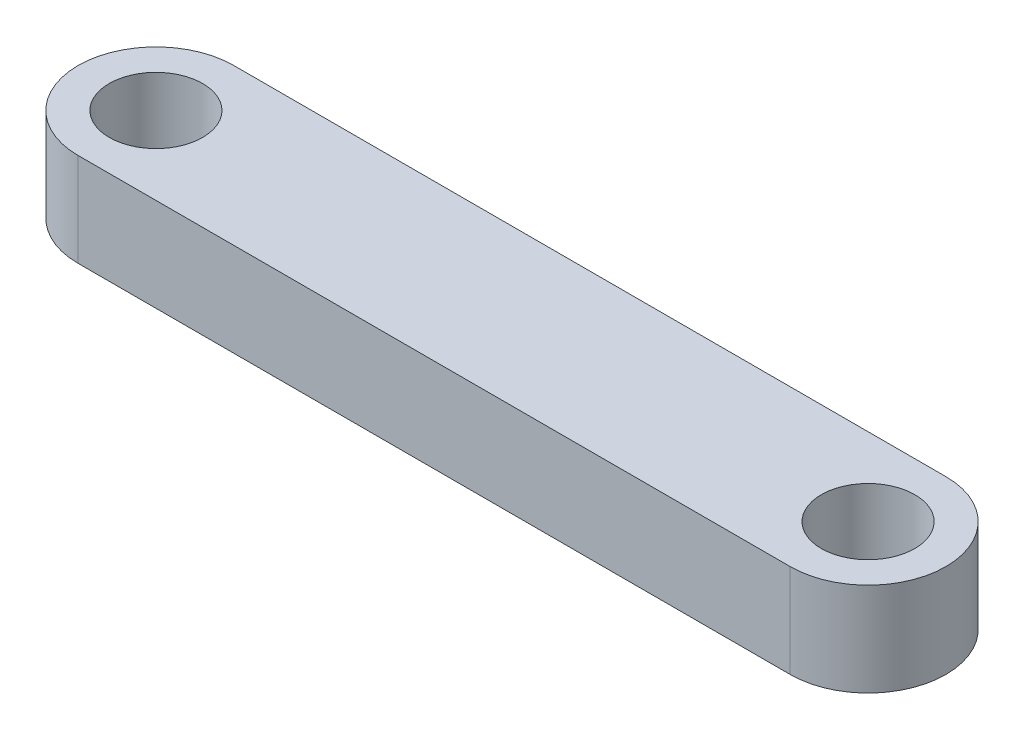
ISO-10303-21;
HEADER;
FILE_DESCRIPTION(('STEP AP214'),'2;1');
FILE_NAME('part.step','',(''),(''),'','','');
FILE_SCHEMA(('AUTOMOTIVE_DESIGN { 1 0 10303 214 1 1 1 1 }'));
ENDSEC;
DATA;
#1=APPLICATION_CONTEXT('core data for automotive mechanical design processes');
#2=APPLICATION_PROTOCOL_DEFINITION('international standard','automotive_design',2000,#1);
#3=PRODUCT_CONTEXT('',#1,'mechanical');
#4=PRODUCT('Part','Part','',(#3));
#5=PRODUCT_RELATED_PRODUCT_CATEGORY('part','',(#4));
#6=PRODUCT_DEFINITION_FORMATION('','',#4);
#7=PRODUCT_DEFINITION_CONTEXT('part definition',#1,'design');
#8=PRODUCT_DEFINITION('design','',#6,#7);
#9=PRODUCT_DEFINITION_SHAPE('','',#8);
#10=(LENGTH_UNIT() NAMED_UNIT(*) SI_UNIT(.MILLI.,.METRE.));
#11=(NAMED_UNIT(*) PLANE_ANGLE_UNIT() SI_UNIT($,.RADIAN.));
#12=(NAMED_UNIT(*) SI_UNIT($,.STERADIAN.) SOLID_ANGLE_UNIT());
#13=UNCERTAINTY_MEASURE_WITH_UNIT(LENGTH_MEASURE(1.E-05),#10,'distance_accuracy_value','');
#14=(GEOMETRIC_REPRESENTATION_CONTEXT(3) GLOBAL_UNCERTAINTY_ASSIGNED_CONTEXT((#13)) GLOBAL_UNIT_ASSIGNED_CONTEXT((#10,
#11,#12)) REPRESENTATION_CONTEXT('',''));
#15=CARTESIAN_POINT('',(0.,0.,0.));
#16=DIRECTION('',(0.,0.,1.));
#17=DIRECTION('',(1.,0.,0.));
#18=AXIS2_PLACEMENT_3D('',#15,#16,#17);
#19=CARTESIAN_POINT('',(11.43,1.5,0.));
#20=DIRECTION('',(0.,1.,0.));
#21=DIRECTION('',(0.,0.,1.));
#22=AXIS2_PLACEMENT_3D('',#19,#20,#21);
#23=PLANE('',#22);
#24=CARTESIAN_POINT('',(-11.43,1.5,0.));
#25=DIRECTION('',(0.,1.,0.));
#26=DIRECTION('',(0.,0.,1.));
#27=AXIS2_PLACEMENT_3D('',#24,#25,#26);
#28=CIRCLE('',#27,1.5);
#29=CARTESIAN_POINT('',(-11.43,1.5,1.5));
#30=VERTEX_POINT('',#29);
#31=EDGE_CURVE('E118',#30,#30,#28,.T.);
#32=ORIENTED_EDGE('',*,*,#31,.F.);
#33=EDGE_LOOP('',(#32));
#34=FACE_BOUND('',#33,.T.);
#35=CARTESIAN_POINT('',(11.43,1.5,0.));
#36=DIRECTION('',(0.,1.,0.));
#37=DIRECTION('',(0.,0.,1.));
#38=AXIS2_PLACEMENT_3D('',#35,#36,#37);
#39=CIRCLE('',#38,2.5);
#40=CARTESIAN_POINT('',(11.43,1.5,2.5));
#41=VERTEX_POINT('',#40);
#42=CARTESIAN_POINT('',(11.43,1.5,-2.5));
#43=VERTEX_POINT('',#42);
#44=EDGE_CURVE('E98',#41,#43,#39,.T.);
#45=ORIENTED_EDGE('',*,*,#44,.T.);
#46=DIRECTION('',(-1.,0.,0.));
#47=VECTOR('',#46,1.);
#48=CARTESIAN_POINT('',(-11.43,1.5,-2.5));
#49=LINE('',#48,#47);
#50=CARTESIAN_POINT('',(-11.43,1.5,-2.5));
#51=VERTEX_POINT('',#50);
#52=EDGE_CURVE('E93',#43,#51,#49,.T.);
#53=ORIENTED_EDGE('',*,*,#52,.T.);
#54=CARTESIAN_POINT('',(-11.43,1.5,0.));
#55=DIRECTION('',(0.,1.,0.));
#56=DIRECTION('',(0.,0.,1.));
#57=AXIS2_PLACEMENT_3D('',#54,#55,#56);
#58=CIRCLE('',#57,2.5);
#59=CARTESIAN_POINT('',(-11.43,1.5,2.5));
#60=VERTEX_POINT('',#59);
#61=EDGE_CURVE('E96',#51,#60,#58,.T.);
#62=ORIENTED_EDGE('',*,*,#61,.T.);
#63=DIRECTION('',(1.,0.,0.));
#64=VECTOR('',#63,1.);
#65=CARTESIAN_POINT('',(-11.43,1.5,2.5));
#66=LINE('',#65,#64);
#67=EDGE_CURVE('E63',#60,#41,#66,.T.);
#68=ORIENTED_EDGE('',*,*,#67,.T.);
#69=EDGE_LOOP('',(#45,#53,#62,#68));
#70=FACE_BOUND('',#69,.T.);
#71=CARTESIAN_POINT('',(11.43,1.5,0.));
#72=DIRECTION('',(0.,1.,0.));
#73=DIRECTION('',(0.,0.,1.));
#74=AXIS2_PLACEMENT_3D('',#71,#72,#73);
#75=CIRCLE('',#74,1.5);
#76=CARTESIAN_POINT('',(11.43,1.5,1.5));
#77=VERTEX_POINT('',#76);
#78=EDGE_CURVE('E140',#77,#77,#75,.T.);
#79=ORIENTED_EDGE('',*,*,#78,.F.);
#80=EDGE_LOOP('',(#79));
#81=FACE_BOUND('',#80,.T.);
#82=ADVANCED_FACE('F45',(#34,#70,#81),#23,.T.);
#83=CARTESIAN_POINT('',(11.43,-1.5,0.));
#84=DIRECTION('',(0.,1.,0.));
#85=DIRECTION('',(0.,0.,1.));
#86=AXIS2_PLACEMENT_3D('',#83,#84,#85);
#87=PLANE('',#86);
#88=CARTESIAN_POINT('',(11.43,-1.5,0.));
#89=DIRECTION('',(0.,1.,0.));
#90=DIRECTION('',(0.,0.,1.));
#91=AXIS2_PLACEMENT_3D('',#88,#89,#90);
#92=CIRCLE('',#91,2.5);
#93=CARTESIAN_POINT('',(11.43,-1.5,2.5));
#94=VERTEX_POINT('',#93);
#95=CARTESIAN_POINT('',(11.43,-1.5,-2.5));
#96=VERTEX_POINT('',#95);
#97=EDGE_CURVE('E114',#94,#96,#92,.T.);
#98=ORIENTED_EDGE('',*,*,#97,.F.);
#99=DIRECTION('',(1.,0.,0.));
#100=VECTOR('',#99,1.);
#101=CARTESIAN_POINT('',(-11.43,-1.5,2.5));
#102=LINE('',#101,#100);
#103=CARTESIAN_POINT('',(-11.43,-1.5,2.5));
#104=VERTEX_POINT('',#103);
#105=EDGE_CURVE('E86',#104,#94,#102,.T.);
#106=ORIENTED_EDGE('',*,*,#105,.F.);
#107=CARTESIAN_POINT('',(-11.43,-1.5,0.));
#108=DIRECTION('',(0.,1.,0.));
#109=DIRECTION('',(0.,0.,1.));
#110=AXIS2_PLACEMENT_3D('',#107,#108,#109);
#111=CIRCLE('',#110,2.5);
#112=CARTESIAN_POINT('',(-11.43,-1.5,-2.5));
#113=VERTEX_POINT('',#112);
#114=EDGE_CURVE('E80',#113,#104,#111,.T.);
#115=ORIENTED_EDGE('',*,*,#114,.F.);
#116=DIRECTION('',(-1.,0.,0.));
#117=VECTOR('',#116,1.);
#118=CARTESIAN_POINT('',(-11.43,-1.5,-2.5));
#119=LINE('',#118,#117);
#120=EDGE_CURVE('E103',#96,#113,#119,.T.);
#121=ORIENTED_EDGE('',*,*,#120,.F.);
#122=EDGE_LOOP('',(#98,#106,#115,#121));
#123=FACE_BOUND('',#122,.T.);
#124=CARTESIAN_POINT('',(-11.43,-1.5,0.));
#125=DIRECTION('',(0.,1.,0.));
#126=DIRECTION('',(0.,0.,1.));
#127=AXIS2_PLACEMENT_3D('',#124,#125,#126);
#128=CIRCLE('',#127,1.5);
#129=CARTESIAN_POINT('',(-11.43,-1.5,1.5));
#130=VERTEX_POINT('',#129);
#131=EDGE_CURVE('E136',#130,#130,#128,.T.);
#132=ORIENTED_EDGE('',*,*,#131,.T.);
#133=EDGE_LOOP('',(#132));
#134=FACE_BOUND('',#133,.T.);
#135=CARTESIAN_POINT('',(11.43,-1.5,0.));
#136=DIRECTION('',(0.,1.,0.));
#137=DIRECTION('',(0.,0.,1.));
#138=AXIS2_PLACEMENT_3D('',#135,#136,#137);
#139=CIRCLE('',#138,1.5);
#140=CARTESIAN_POINT('',(11.43,-1.5,1.5));
#141=VERTEX_POINT('',#140);
#142=EDGE_CURVE('E144',#141,#141,#139,.T.);
#143=ORIENTED_EDGE('',*,*,#142,.T.);
#144=EDGE_LOOP('',(#143));
#145=FACE_BOUND('',#144,.T.);
#146=ADVANCED_FACE('F131',(#123,#134,#145),#87,.F.);
#147=CARTESIAN_POINT('',(11.43,1.5,0.));
#148=DIRECTION('',(0.,-1.,0.));
#149=DIRECTION('',(0.,0.,-1.));
#150=AXIS2_PLACEMENT_3D('',#147,#148,#149);
#151=CYLINDRICAL_SURFACE('',#150,2.5);
#152=ORIENTED_EDGE('',*,*,#97,.T.);
#153=DIRECTION('',(0.,-1.,0.));
#154=VECTOR('',#153,1.);
#155=CARTESIAN_POINT('',(11.43,1.5,-2.5));
#156=LINE('',#155,#154);
#157=EDGE_CURVE('E11',#43,#96,#156,.T.);
#158=ORIENTED_EDGE('',*,*,#157,.F.);
#159=ORIENTED_EDGE('',*,*,#44,.F.);
#160=DIRECTION('',(0.,-1.,0.));
#161=VECTOR('',#160,1.);
#162=CARTESIAN_POINT('',(11.43,1.5,2.5));
#163=LINE('',#162,#161);
#164=EDGE_CURVE('E110',#41,#94,#163,.T.);
#165=ORIENTED_EDGE('',*,*,#164,.T.);
#166=EDGE_LOOP('',(#152,#158,#159,#165));
#167=FACE_BOUND('',#166,.T.);
#168=ADVANCED_FACE('F47',(#167),#151,.T.);
#169=CARTESIAN_POINT('',(-11.43,1.5,-2.5));
#170=DIRECTION('',(0.,0.,1.));
#171=DIRECTION('',(1.,0.,0.));
#172=AXIS2_PLACEMENT_3D('',#169,#170,#171);
#173=PLANE('',#172);
#174=ORIENTED_EDGE('',*,*,#120,.T.);
#175=DIRECTION('',(0.,-1.,0.));
#176=VECTOR('',#175,1.);
#177=CARTESIAN_POINT('',(-11.43,1.5,-2.5));
#178=LINE('',#177,#176);
#179=EDGE_CURVE('E55',#51,#113,#178,.T.);
#180=ORIENTED_EDGE('',*,*,#179,.F.);
#181=ORIENTED_EDGE('',*,*,#52,.F.);
#182=ORIENTED_EDGE('',*,*,#157,.T.);
#183=EDGE_LOOP('',(#174,#180,#181,#182));
#184=FACE_BOUND('',#183,.T.);
#185=ADVANCED_FACE('F102',(#184),#173,.F.);
#186=CARTESIAN_POINT('',(-11.43,1.5,0.));
#187=DIRECTION('',(0.,-1.,0.));
#188=DIRECTION('',(0.,0.,-1.));
#189=AXIS2_PLACEMENT_3D('',#186,#187,#188);
#190=CYLINDRICAL_SURFACE('',#189,2.5);
#191=ORIENTED_EDGE('',*,*,#114,.T.);
#192=DIRECTION('',(0.,-1.,0.));
#193=VECTOR('',#192,1.);
#194=CARTESIAN_POINT('',(-11.43,1.5,2.5));
#195=LINE('',#194,#193);
#196=EDGE_CURVE('E105',#60,#104,#195,.T.);
#197=ORIENTED_EDGE('',*,*,#196,.F.);
#198=ORIENTED_EDGE('',*,*,#61,.F.);
#199=ORIENTED_EDGE('',*,*,#179,.T.);
#200=EDGE_LOOP('',(#191,#197,#198,#199));
#201=FACE_BOUND('',#200,.T.);
#202=ADVANCED_FACE('F106',(#201),#190,.T.);
#203=CARTESIAN_POINT('',(-11.43,1.5,2.5));
#204=DIRECTION('',(0.,0.,-1.));
#205=DIRECTION('',(-1.,0.,0.));
#206=AXIS2_PLACEMENT_3D('',#203,#204,#205);
#207=PLANE('',#206);
#208=ORIENTED_EDGE('',*,*,#105,.T.);
#209=ORIENTED_EDGE('',*,*,#164,.F.);
#210=ORIENTED_EDGE('',*,*,#67,.F.);
#211=ORIENTED_EDGE('',*,*,#196,.T.);
#212=EDGE_LOOP('',(#208,#209,#210,#211));
#213=FACE_BOUND('',#212,.T.);
#214=ADVANCED_FACE('F128',(#213),#207,.F.);
#215=CARTESIAN_POINT('',(-11.43,1.5,0.));
#216=DIRECTION('',(0.,-1.,0.));
#217=DIRECTION('',(0.,0.,-1.));
#218=AXIS2_PLACEMENT_3D('',#215,#216,#217);
#219=CYLINDRICAL_SURFACE('',#218,1.5);
#220=ORIENTED_EDGE('',*,*,#31,.T.);
#221=EDGE_LOOP('',(#220));
#222=FACE_BOUND('',#221,.T.);
#223=ORIENTED_EDGE('',*,*,#131,.F.);
#224=EDGE_LOOP('',(#223));
#225=FACE_BOUND('',#224,.T.);
#226=ADVANCED_FACE('F163',(#222,#225),#219,.F.);
#227=CARTESIAN_POINT('',(11.43,1.5,0.));
#228=DIRECTION('',(0.,-1.,0.));
#229=DIRECTION('',(0.,0.,-1.));
#230=AXIS2_PLACEMENT_3D('',#227,#228,#229);
#231=CYLINDRICAL_SURFACE('',#230,1.5);
#232=ORIENTED_EDGE('',*,*,#78,.T.);
#233=EDGE_LOOP('',(#232));
#234=FACE_BOUND('',#233,.T.);
#235=ORIENTED_EDGE('',*,*,#142,.F.);
#236=EDGE_LOOP('',(#235));
#237=FACE_BOUND('',#236,.T.);
#238=ADVANCED_FACE('F152',(#234,#237),#231,.F.);
#239=CLOSED_SHELL('',(#82,#146,#168,#185,#202,#214,#226,#238));
#240=MANIFOLD_SOLID_BREP('B2',#239);
#241=ADVANCED_BREP_SHAPE_REPRESENTATION('',(#18,#240),#14);
#242=SHAPE_DEFINITION_REPRESENTATION(#9,#241);
ENDSEC;
END-ISO-10303-21;
